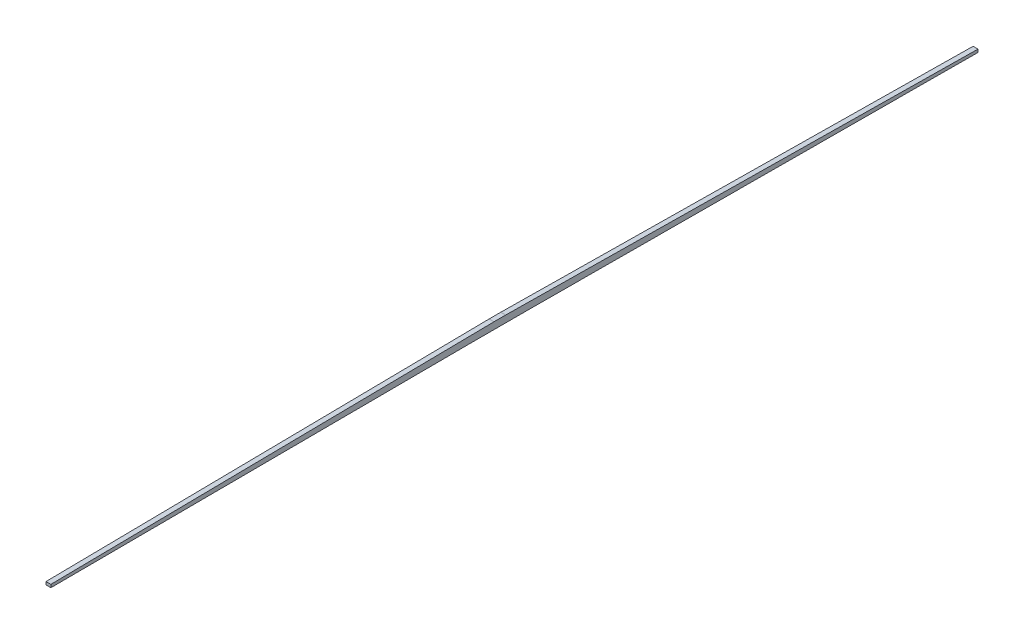
ISO-10303-21;
HEADER;
FILE_DESCRIPTION(('STEP AP214'),'2;1');
FILE_NAME('part.step','',(''),(''),'','','');
FILE_SCHEMA(('AUTOMOTIVE_DESIGN { 1 0 10303 214 1 1 1 1 }'));
ENDSEC;
DATA;
#1=APPLICATION_CONTEXT('core data for automotive mechanical design processes');
#2=APPLICATION_PROTOCOL_DEFINITION('international standard','automotive_design',2000,#1);
#3=PRODUCT_CONTEXT('',#1,'mechanical');
#4=PRODUCT('Part','Part','',(#3));
#5=PRODUCT_RELATED_PRODUCT_CATEGORY('part','',(#4));
#6=PRODUCT_DEFINITION_FORMATION('','',#4);
#7=PRODUCT_DEFINITION_CONTEXT('part definition',#1,'design');
#8=PRODUCT_DEFINITION('design','',#6,#7);
#9=PRODUCT_DEFINITION_SHAPE('','',#8);
#10=(LENGTH_UNIT() NAMED_UNIT(*) SI_UNIT(.MILLI.,.METRE.));
#11=(NAMED_UNIT(*) PLANE_ANGLE_UNIT() SI_UNIT($,.RADIAN.));
#12=(NAMED_UNIT(*) SI_UNIT($,.STERADIAN.) SOLID_ANGLE_UNIT());
#13=UNCERTAINTY_MEASURE_WITH_UNIT(LENGTH_MEASURE(1.E-05),#10,'distance_accuracy_value','');
#14=(GEOMETRIC_REPRESENTATION_CONTEXT(3) GLOBAL_UNCERTAINTY_ASSIGNED_CONTEXT((#13)) GLOBAL_UNIT_ASSIGNED_CONTEXT((#10,
#11,#12)) REPRESENTATION_CONTEXT('',''));
#15=CARTESIAN_POINT('',(0.,0.,0.));
#16=DIRECTION('',(0.,0.,1.));
#17=DIRECTION('',(1.,0.,0.));
#18=AXIS2_PLACEMENT_3D('',#15,#16,#17);
#19=CARTESIAN_POINT('',(5.,-6.,460.));
#20=DIRECTION('',(0.,-0.999912681973027,-0.0132147050481017));
#21=DIRECTION('',(0.,0.0132147050481017,-0.999912681973027));
#22=AXIS2_PLACEMENT_3D('',#19,#20,#21);
#23=PLANE('',#22);
#24=DIRECTION('',(0.,-0.0132147050481017,0.999912681973027));
#25=VECTOR('',#24,1.);
#26=CARTESIAN_POINT('',(0.,-6.,460.));
#27=LINE('',#26,#25);
#28=CARTESIAN_POINT('',(0.,0.,6.));
#29=VERTEX_POINT('',#28);
#30=CARTESIAN_POINT('',(0.,-6.,460.));
#31=VERTEX_POINT('',#30);
#32=EDGE_CURVE('E99',#29,#31,#27,.T.);
#33=ORIENTED_EDGE('',*,*,#32,.T.);
#34=DIRECTION('',(-1.,0.,0.));
#35=VECTOR('',#34,1.);
#36=CARTESIAN_POINT('',(5.,-6.,460.));
#37=LINE('',#36,#35);
#38=CARTESIAN_POINT('',(5.,-6.,460.));
#39=VERTEX_POINT('',#38);
#40=EDGE_CURVE('E11',#39,#31,#37,.T.);
#41=ORIENTED_EDGE('',*,*,#40,.F.);
#42=DIRECTION('',(0.,-0.0132147050481017,0.999912681973027));
#43=VECTOR('',#42,1.);
#44=CARTESIAN_POINT('',(5.,-6.,460.));
#45=LINE('',#44,#43);
#46=CARTESIAN_POINT('',(5.,0.,6.));
#47=VERTEX_POINT('',#46);
#48=EDGE_CURVE('E126',#47,#39,#45,.T.);
#49=ORIENTED_EDGE('',*,*,#48,.F.);
#50=DIRECTION('',(-1.,0.,0.));
#51=VECTOR('',#50,1.);
#52=CARTESIAN_POINT('',(5.,0.,6.));
#53=LINE('',#52,#51);
#54=EDGE_CURVE('E112',#47,#29,#53,.T.);
#55=ORIENTED_EDGE('',*,*,#54,.T.);
#56=EDGE_LOOP('',(#33,#41,#49,#55));
#57=FACE_BOUND('',#56,.T.);
#58=ADVANCED_FACE('F31',(#57),#23,.F.);
#59=CARTESIAN_POINT('',(5.,-9.,460.));
#60=DIRECTION('',(0.,0.,-1.));
#61=DIRECTION('',(-1.,0.,0.));
#62=AXIS2_PLACEMENT_3D('',#59,#60,#61);
#63=PLANE('',#62);
#64=DIRECTION('',(0.,-1.,0.));
#65=VECTOR('',#64,1.);
#66=CARTESIAN_POINT('',(0.,-9.,460.));
#67=LINE('',#66,#65);
#68=CARTESIAN_POINT('',(0.,-9.,460.));
#69=VERTEX_POINT('',#68);
#70=EDGE_CURVE('E95',#31,#69,#67,.T.);
#71=ORIENTED_EDGE('',*,*,#70,.T.);
#72=DIRECTION('',(-1.,0.,0.));
#73=VECTOR('',#72,1.);
#74=CARTESIAN_POINT('',(5.,-9.,460.));
#75=LINE('',#74,#73);
#76=CARTESIAN_POINT('',(5.,-9.,460.));
#77=VERTEX_POINT('',#76);
#78=EDGE_CURVE('E38',#77,#69,#75,.T.);
#79=ORIENTED_EDGE('',*,*,#78,.F.);
#80=DIRECTION('',(0.,-1.,0.));
#81=VECTOR('',#80,1.);
#82=CARTESIAN_POINT('',(5.,-9.,460.));
#83=LINE('',#82,#81);
#84=EDGE_CURVE('E108',#39,#77,#83,.T.);
#85=ORIENTED_EDGE('',*,*,#84,.F.);
#86=ORIENTED_EDGE('',*,*,#40,.T.);
#87=EDGE_LOOP('',(#71,#79,#85,#86));
#88=FACE_BOUND('',#87,.T.);
#89=ADVANCED_FACE('F107',(#88),#63,.F.);
#90=CARTESIAN_POINT('',(5.,-7.,30.));
#91=DIRECTION('',(0.,0.999989183517844,0.00465111248147835));
#92=DIRECTION('',(0.,-0.00465111248147835,0.999989183517844));
#93=AXIS2_PLACEMENT_3D('',#90,#91,#92);
#94=PLANE('',#93);
#95=DIRECTION('',(0.,0.00465111248147835,-0.999989183517844));
#96=VECTOR('',#95,1.);
#97=CARTESIAN_POINT('',(0.,-7.,30.));
#98=LINE('',#97,#96);
#99=CARTESIAN_POINT('',(0.,-7.,30.));
#100=VERTEX_POINT('',#99);
#101=EDGE_CURVE('E101',#69,#100,#98,.T.);
#102=ORIENTED_EDGE('',*,*,#101,.T.);
#103=DIRECTION('',(-1.,0.,0.));
#104=VECTOR('',#103,1.);
#105=CARTESIAN_POINT('',(5.,-7.,30.));
#106=LINE('',#105,#104);
#107=CARTESIAN_POINT('',(5.,-7.,30.));
#108=VERTEX_POINT('',#107);
#109=EDGE_CURVE('E152',#108,#100,#106,.T.);
#110=ORIENTED_EDGE('',*,*,#109,.F.);
#111=DIRECTION('',(0.,0.00465111248147835,-0.999989183517844));
#112=VECTOR('',#111,1.);
#113=CARTESIAN_POINT('',(5.,-7.,30.));
#114=LINE('',#113,#112);
#115=EDGE_CURVE('E129',#77,#108,#114,.T.);
#116=ORIENTED_EDGE('',*,*,#115,.F.);
#117=ORIENTED_EDGE('',*,*,#78,.T.);
#118=EDGE_LOOP('',(#102,#110,#116,#117));
#119=FACE_BOUND('',#118,.T.);
#120=ADVANCED_FACE('F156',(#119),#94,.F.);
#121=CARTESIAN_POINT('',(5.,-7.,30.));
#122=DIRECTION('',(0.,1.,0.));
#123=DIRECTION('',(0.,0.,1.));
#124=AXIS2_PLACEMENT_3D('',#121,#122,#123);
#125=PLANE('',#124);
#126=DIRECTION('',(0.,0.,-1.));
#127=VECTOR('',#126,1.);
#128=CARTESIAN_POINT('',(0.,-7.,30.));
#129=LINE('',#128,#127);
#130=CARTESIAN_POINT('',(0.,-6.99999999999999,-30.));
#131=VERTEX_POINT('',#130);
#132=EDGE_CURVE('E116',#100,#131,#129,.T.);
#133=ORIENTED_EDGE('',*,*,#132,.T.);
#134=DIRECTION('',(-1.,0.,0.));
#135=VECTOR('',#134,1.);
#136=CARTESIAN_POINT('',(5.,-6.99999999999999,-30.));
#137=LINE('',#136,#135);
#138=CARTESIAN_POINT('',(5.,-6.99999999999999,-30.));
#139=VERTEX_POINT('',#138);
#140=EDGE_CURVE('E149',#139,#131,#137,.T.);
#141=ORIENTED_EDGE('',*,*,#140,.F.);
#142=DIRECTION('',(0.,0.,-1.));
#143=VECTOR('',#142,1.);
#144=CARTESIAN_POINT('',(5.,-7.,30.));
#145=LINE('',#144,#143);
#146=EDGE_CURVE('E131',#108,#139,#145,.T.);
#147=ORIENTED_EDGE('',*,*,#146,.F.);
#148=ORIENTED_EDGE('',*,*,#109,.T.);
#149=EDGE_LOOP('',(#133,#141,#147,#148));
#150=FACE_BOUND('',#149,.T.);
#151=ADVANCED_FACE('F164',(#150),#125,.F.);
#152=CARTESIAN_POINT('',(5.,-9.,-490.));
#153=DIRECTION('',(0.,0.999990548338161,-0.00434778499277463));
#154=DIRECTION('',(0.,0.00434778499277463,0.999990548338161));
#155=AXIS2_PLACEMENT_3D('',#152,#153,#154);
#156=PLANE('',#155);
#157=DIRECTION('',(0.,-0.00434778499277463,-0.999990548338161));
#158=VECTOR('',#157,1.);
#159=CARTESIAN_POINT('',(0.,-9.,-490.));
#160=LINE('',#159,#158);
#161=CARTESIAN_POINT('',(0.,-9.,-490.));
#162=VERTEX_POINT('',#161);
#163=EDGE_CURVE('E118',#131,#162,#160,.T.);
#164=ORIENTED_EDGE('',*,*,#163,.T.);
#165=DIRECTION('',(-1.,0.,0.));
#166=VECTOR('',#165,1.);
#167=CARTESIAN_POINT('',(5.,-9.,-490.));
#168=LINE('',#167,#166);
#169=CARTESIAN_POINT('',(5.,-9.,-490.));
#170=VERTEX_POINT('',#169);
#171=EDGE_CURVE('E146',#170,#162,#168,.T.);
#172=ORIENTED_EDGE('',*,*,#171,.F.);
#173=DIRECTION('',(0.,-0.00434778499277463,-0.999990548338161));
#174=VECTOR('',#173,1.);
#175=CARTESIAN_POINT('',(5.,-9.,-490.));
#176=LINE('',#175,#174);
#177=EDGE_CURVE('E133',#139,#170,#176,.T.);
#178=ORIENTED_EDGE('',*,*,#177,.F.);
#179=ORIENTED_EDGE('',*,*,#140,.T.);
#180=EDGE_LOOP('',(#164,#172,#178,#179));
#181=FACE_BOUND('',#180,.T.);
#182=ADVANCED_FACE('F167',(#181),#156,.F.);
#183=CARTESIAN_POINT('',(5.,-6.,-490.));
#184=DIRECTION('',(0.,0.,1.));
#185=DIRECTION('',(1.,0.,0.));
#186=AXIS2_PLACEMENT_3D('',#183,#184,#185);
#187=PLANE('',#186);
#188=DIRECTION('',(0.,1.,0.));
#189=VECTOR('',#188,1.);
#190=CARTESIAN_POINT('',(0.,-6.,-490.));
#191=LINE('',#190,#189);
#192=CARTESIAN_POINT('',(0.,-6.,-490.));
#193=VERTEX_POINT('',#192);
#194=EDGE_CURVE('E120',#162,#193,#191,.T.);
#195=ORIENTED_EDGE('',*,*,#194,.T.);
#196=DIRECTION('',(-1.,0.,0.));
#197=VECTOR('',#196,1.);
#198=CARTESIAN_POINT('',(5.,-6.,-490.));
#199=LINE('',#198,#197);
#200=CARTESIAN_POINT('',(5.,-6.,-490.));
#201=VERTEX_POINT('',#200);
#202=EDGE_CURVE('E143',#201,#193,#199,.T.);
#203=ORIENTED_EDGE('',*,*,#202,.F.);
#204=DIRECTION('',(0.,1.,0.));
#205=VECTOR('',#204,1.);
#206=CARTESIAN_POINT('',(5.,-6.,-490.));
#207=LINE('',#206,#205);
#208=EDGE_CURVE('E135',#170,#201,#207,.T.);
#209=ORIENTED_EDGE('',*,*,#208,.F.);
#210=ORIENTED_EDGE('',*,*,#171,.T.);
#211=EDGE_LOOP('',(#195,#203,#209,#210));
#212=FACE_BOUND('',#211,.T.);
#213=ADVANCED_FACE('F172',(#212),#187,.F.);
#214=CARTESIAN_POINT('',(5.,0.,-6.));
#215=DIRECTION('',(0.,-0.999923169841488,0.0123957417748945));
#216=DIRECTION('',(0.,-0.0123957417748945,-0.999923169841488));
#217=AXIS2_PLACEMENT_3D('',#214,#215,#216);
#218=PLANE('',#217);
#219=DIRECTION('',(0.,0.0123957417748945,0.999923169841488));
#220=VECTOR('',#219,1.);
#221=CARTESIAN_POINT('',(0.,0.,-6.));
#222=LINE('',#221,#220);
#223=CARTESIAN_POINT('',(0.,0.,-6.));
#224=VERTEX_POINT('',#223);
#225=EDGE_CURVE('E122',#193,#224,#222,.T.);
#226=ORIENTED_EDGE('',*,*,#225,.T.);
#227=DIRECTION('',(-1.,0.,0.));
#228=VECTOR('',#227,1.);
#229=CARTESIAN_POINT('',(5.,0.,-6.));
#230=LINE('',#229,#228);
#231=CARTESIAN_POINT('',(5.,0.,-6.));
#232=VERTEX_POINT('',#231);
#233=EDGE_CURVE('E140',#232,#224,#230,.T.);
#234=ORIENTED_EDGE('',*,*,#233,.F.);
#235=DIRECTION('',(0.,0.0123957417748945,0.999923169841488));
#236=VECTOR('',#235,1.);
#237=CARTESIAN_POINT('',(5.,0.,-6.));
#238=LINE('',#237,#236);
#239=EDGE_CURVE('E50',#201,#232,#238,.T.);
#240=ORIENTED_EDGE('',*,*,#239,.F.);
#241=ORIENTED_EDGE('',*,*,#202,.T.);
#242=EDGE_LOOP('',(#226,#234,#240,#241));
#243=FACE_BOUND('',#242,.T.);
#244=ADVANCED_FACE('F175',(#243),#218,.F.);
#245=CARTESIAN_POINT('',(5.,0.,6.));
#246=DIRECTION('',(0.,-1.,0.));
#247=DIRECTION('',(0.,0.,-1.));
#248=AXIS2_PLACEMENT_3D('',#245,#246,#247);
#249=PLANE('',#248);
#250=DIRECTION('',(0.,0.,1.));
#251=VECTOR('',#250,1.);
#252=CARTESIAN_POINT('',(0.,0.,6.));
#253=LINE('',#252,#251);
#254=EDGE_CURVE('E124',#224,#29,#253,.T.);
#255=ORIENTED_EDGE('',*,*,#254,.T.);
#256=ORIENTED_EDGE('',*,*,#54,.F.);
#257=DIRECTION('',(0.,0.,1.));
#258=VECTOR('',#257,1.);
#259=CARTESIAN_POINT('',(5.,0.,6.));
#260=LINE('',#259,#258);
#261=EDGE_CURVE('E45',#232,#47,#260,.T.);
#262=ORIENTED_EDGE('',*,*,#261,.F.);
#263=ORIENTED_EDGE('',*,*,#233,.T.);
#264=EDGE_LOOP('',(#255,#256,#262,#263));
#265=FACE_BOUND('',#264,.T.);
#266=ADVANCED_FACE('F177',(#265),#249,.F.);
#267=CARTESIAN_POINT('',(5.,6.55506607929516,-490.));
#268=DIRECTION('',(-1.,0.,0.));
#269=DIRECTION('',(0.,0.,1.));
#270=AXIS2_PLACEMENT_3D('',#267,#268,#269);
#271=PLANE('',#270);
#272=ORIENTED_EDGE('',*,*,#48,.T.);
#273=ORIENTED_EDGE('',*,*,#84,.T.);
#274=ORIENTED_EDGE('',*,*,#115,.T.);
#275=ORIENTED_EDGE('',*,*,#146,.T.);
#276=ORIENTED_EDGE('',*,*,#177,.T.);
#277=ORIENTED_EDGE('',*,*,#208,.T.);
#278=ORIENTED_EDGE('',*,*,#239,.T.);
#279=ORIENTED_EDGE('',*,*,#261,.T.);
#280=EDGE_LOOP('',(#272,#273,#274,#275,#276,#277,#278,#279));
#281=FACE_BOUND('',#280,.T.);
#282=ADVANCED_FACE('F159',(#281),#271,.F.);
#283=CARTESIAN_POINT('',(0.,6.55506607929516,-490.));
#284=DIRECTION('',(-1.,0.,0.));
#285=DIRECTION('',(0.,0.,1.));
#286=AXIS2_PLACEMENT_3D('',#283,#284,#285);
#287=PLANE('',#286);
#288=ORIENTED_EDGE('',*,*,#32,.F.);
#289=ORIENTED_EDGE('',*,*,#254,.F.);
#290=ORIENTED_EDGE('',*,*,#225,.F.);
#291=ORIENTED_EDGE('',*,*,#194,.F.);
#292=ORIENTED_EDGE('',*,*,#163,.F.);
#293=ORIENTED_EDGE('',*,*,#132,.F.);
#294=ORIENTED_EDGE('',*,*,#101,.F.);
#295=ORIENTED_EDGE('',*,*,#70,.F.);
#296=EDGE_LOOP('',(#288,#289,#290,#291,#292,#293,#294,#295));
#297=FACE_BOUND('',#296,.T.);
#298=ADVANCED_FACE('F96',(#297),#287,.T.);
#299=CLOSED_SHELL('',(#58,#89,#120,#151,#182,#213,#244,#266,#282,#298));
#300=MANIFOLD_SOLID_BREP('B2',#299);
#301=ADVANCED_BREP_SHAPE_REPRESENTATION('',(#18,#300),#14);
#302=SHAPE_DEFINITION_REPRESENTATION(#9,#301);
ENDSEC;
END-ISO-10303-21;
